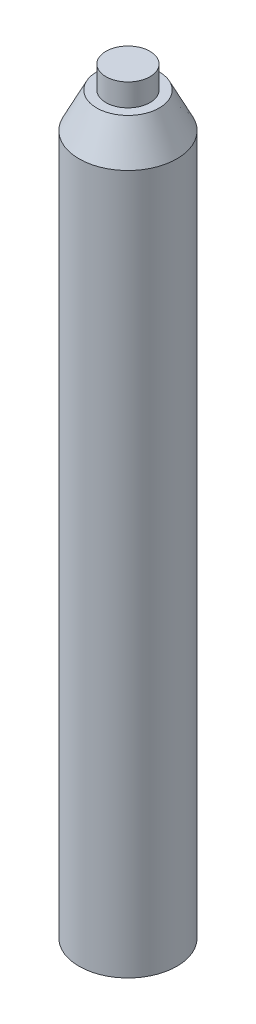
ISO-10303-21;
HEADER;
FILE_DESCRIPTION(('STEP AP214'),'2;1');
FILE_NAME('part.step','',(''),(''),'','','');
FILE_SCHEMA(('AUTOMOTIVE_DESIGN { 1 0 10303 214 1 1 1 1 }'));
ENDSEC;
DATA;
#1=APPLICATION_CONTEXT('core data for automotive mechanical design processes');
#2=APPLICATION_PROTOCOL_DEFINITION('international standard','automotive_design',2000,#1);
#3=PRODUCT_CONTEXT('',#1,'mechanical');
#4=PRODUCT('Part','Part','',(#3));
#5=PRODUCT_RELATED_PRODUCT_CATEGORY('part','',(#4));
#6=PRODUCT_DEFINITION_FORMATION('','',#4);
#7=PRODUCT_DEFINITION_CONTEXT('part definition',#1,'design');
#8=PRODUCT_DEFINITION('design','',#6,#7);
#9=PRODUCT_DEFINITION_SHAPE('','',#8);
#10=(LENGTH_UNIT() NAMED_UNIT(*) SI_UNIT(.MILLI.,.METRE.));
#11=(NAMED_UNIT(*) PLANE_ANGLE_UNIT() SI_UNIT($,.RADIAN.));
#12=(NAMED_UNIT(*) SI_UNIT($,.STERADIAN.) SOLID_ANGLE_UNIT());
#13=UNCERTAINTY_MEASURE_WITH_UNIT(LENGTH_MEASURE(1.E-05),#10,'distance_accuracy_value','');
#14=(GEOMETRIC_REPRESENTATION_CONTEXT(3) GLOBAL_UNCERTAINTY_ASSIGNED_CONTEXT((#13)) GLOBAL_UNIT_ASSIGNED_CONTEXT((#10,
#11,#12)) REPRESENTATION_CONTEXT('',''));
#15=CARTESIAN_POINT('',(0.,0.,0.));
#16=DIRECTION('',(0.,0.,1.));
#17=DIRECTION('',(1.,0.,0.));
#18=AXIS2_PLACEMENT_3D('',#15,#16,#17);
#19=CARTESIAN_POINT('',(0.,0.,0.));
#20=DIRECTION('',(0.,-1.,0.));
#21=DIRECTION('',(0.,0.,-1.));
#22=AXIS2_PLACEMENT_3D('',#19,#20,#21);
#23=PLANE('',#22);
#24=CARTESIAN_POINT('',(0.,0.,0.));
#25=DIRECTION('',(0.,-1.,0.));
#26=DIRECTION('',(0.,0.,-1.));
#27=AXIS2_PLACEMENT_3D('',#24,#25,#26);
#28=CIRCLE('',#27,2.5908);
#29=CARTESIAN_POINT('',(0.,0.,-2.5908));
#30=VERTEX_POINT('',#29);
#31=EDGE_CURVE('E52',#30,#30,#28,.T.);
#32=ORIENTED_EDGE('',*,*,#31,.F.);
#33=EDGE_LOOP('',(#32));
#34=FACE_BOUND('',#33,.T.);
#35=CARTESIAN_POINT('',(0.,0.,0.));
#36=DIRECTION('',(0.,1.,0.));
#37=DIRECTION('',(0.,0.,1.));
#38=AXIS2_PLACEMENT_3D('',#35,#36,#37);
#39=CIRCLE('',#38,5.55);
#40=CARTESIAN_POINT('',(0.,0.,5.55));
#41=VERTEX_POINT('',#40);
#42=EDGE_CURVE('E11',#41,#41,#39,.T.);
#43=ORIENTED_EDGE('',*,*,#42,.F.);
#44=EDGE_LOOP('',(#43));
#45=FACE_BOUND('',#44,.T.);
#46=ADVANCED_FACE('F32',(#34,#45),#23,.T.);
#47=CARTESIAN_POINT('',(0.,90.216,0.));
#48=DIRECTION('',(0.,1.,0.));
#49=DIRECTION('',(0.,0.,1.));
#50=AXIS2_PLACEMENT_3D('',#47,#48,#49);
#51=CYLINDRICAL_SURFACE('',#50,5.55);
#52=ORIENTED_EDGE('',*,*,#42,.T.);
#53=EDGE_LOOP('',(#52));
#54=FACE_BOUND('',#53,.T.);
#55=CARTESIAN_POINT('',(0.,79.37,0.));
#56=DIRECTION('',(0.,1.,0.));
#57=DIRECTION('',(0.,0.,1.));
#58=AXIS2_PLACEMENT_3D('',#55,#56,#57);
#59=CIRCLE('',#58,5.55);
#60=CARTESIAN_POINT('',(0.,79.37,5.55));
#61=VERTEX_POINT('',#60);
#62=EDGE_CURVE('E38',#61,#61,#59,.T.);
#63=ORIENTED_EDGE('',*,*,#62,.F.);
#64=EDGE_LOOP('',(#63));
#65=FACE_BOUND('',#64,.T.);
#66=ADVANCED_FACE('F70',(#54,#65),#51,.T.);
#67=CARTESIAN_POINT('',(0.,83.37,0.));
#68=DIRECTION('',(0.,-1.,0.));
#69=DIRECTION('',(0.,0.,-1.));
#70=AXIS2_PLACEMENT_3D('',#67,#68,#69);
#71=CONICAL_SURFACE('',#70,3.55,0.463647609000806);
#72=ORIENTED_EDGE('',*,*,#62,.T.);
#73=EDGE_LOOP('',(#72));
#74=FACE_BOUND('',#73,.T.);
#75=CARTESIAN_POINT('',(0.,83.37,0.));
#76=DIRECTION('',(0.,1.,0.));
#77=DIRECTION('',(0.,0.,1.));
#78=AXIS2_PLACEMENT_3D('',#75,#76,#77);
#79=CIRCLE('',#78,3.55);
#80=CARTESIAN_POINT('',(0.,83.37,3.55));
#81=VERTEX_POINT('',#80);
#82=EDGE_CURVE('E62',#81,#81,#79,.T.);
#83=ORIENTED_EDGE('',*,*,#82,.F.);
#84=EDGE_LOOP('',(#83));
#85=FACE_BOUND('',#84,.T.);
#86=ADVANCED_FACE('F67',(#74,#85),#71,.T.);
#87=CARTESIAN_POINT('',(-3.55,83.37,0.));
#88=DIRECTION('',(0.,1.,0.));
#89=DIRECTION('',(0.,0.,1.));
#90=AXIS2_PLACEMENT_3D('',#87,#88,#89);
#91=PLANE('',#90);
#92=ORIENTED_EDGE('',*,*,#82,.T.);
#93=EDGE_LOOP('',(#92));
#94=FACE_BOUND('',#93,.T.);
#95=CARTESIAN_POINT('',(0.,83.37,0.));
#96=DIRECTION('',(0.,1.,0.));
#97=DIRECTION('',(0.,0.,1.));
#98=AXIS2_PLACEMENT_3D('',#95,#96,#97);
#99=CIRCLE('',#98,2.50000000000001);
#100=CARTESIAN_POINT('',(0.,83.37,2.50000000000001));
#101=VERTEX_POINT('',#100);
#102=EDGE_CURVE('E55',#101,#101,#99,.T.);
#103=ORIENTED_EDGE('',*,*,#102,.F.);
#104=EDGE_LOOP('',(#103));
#105=FACE_BOUND('',#104,.T.);
#106=ADVANCED_FACE('F77',(#94,#105),#91,.T.);
#107=CARTESIAN_POINT('',(0.,90.216,0.));
#108=DIRECTION('',(0.,1.,0.));
#109=DIRECTION('',(0.,0.,1.));
#110=AXIS2_PLACEMENT_3D('',#107,#108,#109);
#111=CYLINDRICAL_SURFACE('',#110,2.50000000000001);
#112=ORIENTED_EDGE('',*,*,#102,.T.);
#113=EDGE_LOOP('',(#112));
#114=FACE_BOUND('',#113,.T.);
#115=CARTESIAN_POINT('',(0.,85.92,0.));
#116=DIRECTION('',(0.,1.,0.));
#117=DIRECTION('',(0.,0.,1.));
#118=AXIS2_PLACEMENT_3D('',#115,#116,#117);
#119=CIRCLE('',#118,2.50000000000001);
#120=CARTESIAN_POINT('',(0.,85.92,2.50000000000001));
#121=VERTEX_POINT('',#120);
#122=EDGE_CURVE('E51',#121,#121,#119,.T.);
#123=ORIENTED_EDGE('',*,*,#122,.F.);
#124=EDGE_LOOP('',(#123));
#125=FACE_BOUND('',#124,.T.);
#126=ADVANCED_FACE('F83',(#114,#125),#111,.T.);
#127=CARTESIAN_POINT('',(-2.50000000000001,85.92,0.));
#128=DIRECTION('',(0.,1.,0.));
#129=DIRECTION('',(0.,0.,1.));
#130=AXIS2_PLACEMENT_3D('',#127,#128,#129);
#131=PLANE('',#130);
#132=ORIENTED_EDGE('',*,*,#122,.T.);
#133=EDGE_LOOP('',(#132));
#134=FACE_BOUND('',#133,.T.);
#135=ADVANCED_FACE('F45',(#134),#131,.T.);
#136=CARTESIAN_POINT('',(0.,10.,0.));
#137=DIRECTION('',(0.,-1.,0.));
#138=DIRECTION('',(0.,0.,-1.));
#139=AXIS2_PLACEMENT_3D('',#136,#137,#138);
#140=CONICAL_SURFACE('',#139,2.5908,1.02974425867665);
#141=CARTESIAN_POINT('',(0.,11.5567096917766,0.));
#142=VERTEX_POINT('',#141);
#143=VERTEX_LOOP('',#142);
#144=FACE_BOUND('',#143,.T.);
#145=CARTESIAN_POINT('',(0.,10.,0.));
#146=DIRECTION('',(0.,-1.,0.));
#147=DIRECTION('',(0.,0.,-1.));
#148=AXIS2_PLACEMENT_3D('',#145,#146,#147);
#149=CIRCLE('',#148,2.5908);
#150=CARTESIAN_POINT('',(0.,10.,-2.5908));
#151=VERTEX_POINT('',#150);
#152=EDGE_CURVE('E49',#151,#151,#149,.T.);
#153=ORIENTED_EDGE('',*,*,#152,.T.);
#154=EDGE_LOOP('',(#153));
#155=FACE_BOUND('',#154,.T.);
#156=ADVANCED_FACE('F41',(#144,#155),#140,.F.);
#157=CARTESIAN_POINT('',(0.,0.,0.));
#158=DIRECTION('',(0.,-1.,0.));
#159=DIRECTION('',(0.,0.,-1.));
#160=AXIS2_PLACEMENT_3D('',#157,#158,#159);
#161=CYLINDRICAL_SURFACE('',#160,2.5908);
#162=ORIENTED_EDGE('',*,*,#152,.F.);
#163=EDGE_LOOP('',(#162));
#164=FACE_BOUND('',#163,.T.);
#165=ORIENTED_EDGE('',*,*,#31,.T.);
#166=EDGE_LOOP('',(#165));
#167=FACE_BOUND('',#166,.T.);
#168=ADVANCED_FACE('F44',(#164,#167),#161,.F.);
#169=CLOSED_SHELL('',(#46,#66,#86,#106,#126,#135,#156,#168));
#170=MANIFOLD_SOLID_BREP('B2',#169);
#171=ADVANCED_BREP_SHAPE_REPRESENTATION('',(#18,#170),#14);
#172=SHAPE_DEFINITION_REPRESENTATION(#9,#171);
ENDSEC;
END-ISO-10303-21;
